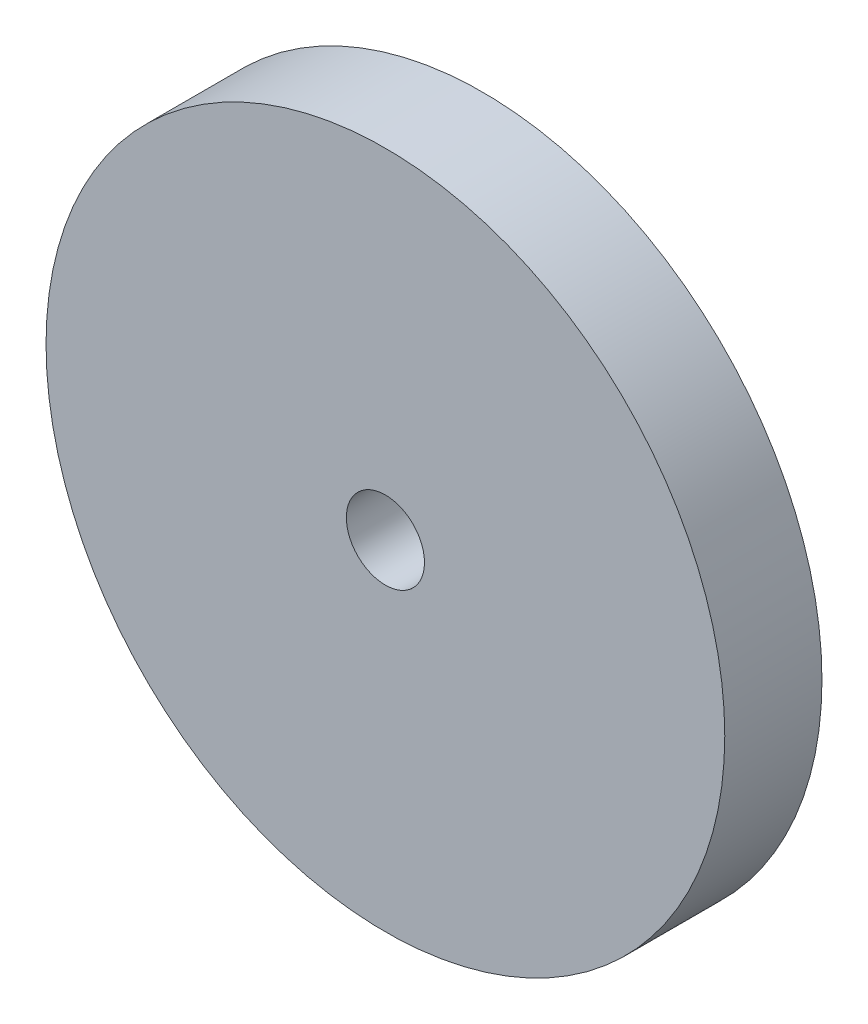
ISO-10303-21;
HEADER;
FILE_DESCRIPTION(('STEP AP214'),'2;1');
FILE_NAME('part.step','',(''),(''),'','','');
FILE_SCHEMA(('AUTOMOTIVE_DESIGN { 1 0 10303 214 1 1 1 1 }'));
ENDSEC;
DATA;
#1=APPLICATION_CONTEXT('core data for automotive mechanical design processes');
#2=APPLICATION_PROTOCOL_DEFINITION('international standard','automotive_design',2000,#1);
#3=PRODUCT_CONTEXT('',#1,'mechanical');
#4=PRODUCT('Part','Part','',(#3));
#5=PRODUCT_RELATED_PRODUCT_CATEGORY('part','',(#4));
#6=PRODUCT_DEFINITION_FORMATION('','',#4);
#7=PRODUCT_DEFINITION_CONTEXT('part definition',#1,'design');
#8=PRODUCT_DEFINITION('design','',#6,#7);
#9=PRODUCT_DEFINITION_SHAPE('','',#8);
#10=(LENGTH_UNIT() NAMED_UNIT(*) SI_UNIT(.MILLI.,.METRE.));
#11=(NAMED_UNIT(*) PLANE_ANGLE_UNIT() SI_UNIT($,.RADIAN.));
#12=(NAMED_UNIT(*) SI_UNIT($,.STERADIAN.) SOLID_ANGLE_UNIT());
#13=UNCERTAINTY_MEASURE_WITH_UNIT(LENGTH_MEASURE(1.E-05),#10,'distance_accuracy_value','');
#14=(GEOMETRIC_REPRESENTATION_CONTEXT(3) GLOBAL_UNCERTAINTY_ASSIGNED_CONTEXT((#13)) GLOBAL_UNIT_ASSIGNED_CONTEXT((#10,
#11,#12)) REPRESENTATION_CONTEXT('',''));
#15=CARTESIAN_POINT('',(0.,0.,0.));
#16=DIRECTION('',(0.,0.,1.));
#17=DIRECTION('',(1.,0.,0.));
#18=AXIS2_PLACEMENT_3D('',#15,#16,#17);
#19=CARTESIAN_POINT('',(0.,0.,6.35));
#20=DIRECTION('',(0.,0.,1.));
#21=DIRECTION('',(1.,0.,0.));
#22=AXIS2_PLACEMENT_3D('',#19,#20,#21);
#23=PLANE('',#22);
#24=CARTESIAN_POINT('',(0.,0.,6.35));
#25=DIRECTION('',(0.,0.,1.));
#26=DIRECTION('',(1.,0.,0.));
#27=AXIS2_PLACEMENT_3D('',#24,#25,#26);
#28=CIRCLE('',#27,22.175);
#29=CARTESIAN_POINT('',(22.175,0.,6.35));
#30=VERTEX_POINT('',#29);
#31=EDGE_CURVE('E10',#30,#30,#28,.T.);
#32=ORIENTED_EDGE('',*,*,#31,.T.);
#33=EDGE_LOOP('',(#32));
#34=FACE_BOUND('',#33,.T.);
#35=CARTESIAN_POINT('',(0.,0.,6.35));
#36=DIRECTION('',(0.,0.,1.));
#37=DIRECTION('',(1.,0.,0.));
#38=AXIS2_PLACEMENT_3D('',#35,#36,#37);
#39=CIRCLE('',#38,2.5527);
#40=CARTESIAN_POINT('',(2.5527,0.,6.35));
#41=VERTEX_POINT('',#40);
#42=EDGE_CURVE('E41',#41,#41,#39,.T.);
#43=ORIENTED_EDGE('',*,*,#42,.F.);
#44=EDGE_LOOP('',(#43));
#45=FACE_BOUND('',#44,.T.);
#46=ADVANCED_FACE('F30',(#34,#45),#23,.T.);
#47=CARTESIAN_POINT('',(0.,0.,0.));
#48=DIRECTION('',(0.,0.,1.));
#49=DIRECTION('',(1.,0.,0.));
#50=AXIS2_PLACEMENT_3D('',#47,#48,#49);
#51=PLANE('',#50);
#52=CARTESIAN_POINT('',(0.,0.,0.));
#53=DIRECTION('',(0.,0.,1.));
#54=DIRECTION('',(1.,0.,0.));
#55=AXIS2_PLACEMENT_3D('',#52,#53,#54);
#56=CIRCLE('',#55,22.175);
#57=CARTESIAN_POINT('',(22.175,0.,0.));
#58=VERTEX_POINT('',#57);
#59=EDGE_CURVE('E34',#58,#58,#56,.T.);
#60=ORIENTED_EDGE('',*,*,#59,.F.);
#61=EDGE_LOOP('',(#60));
#62=FACE_BOUND('',#61,.T.);
#63=CARTESIAN_POINT('',(0.,0.,0.));
#64=DIRECTION('',(0.,0.,1.));
#65=DIRECTION('',(1.,0.,0.));
#66=AXIS2_PLACEMENT_3D('',#63,#64,#65);
#67=CIRCLE('',#66,2.5527);
#68=CARTESIAN_POINT('',(2.5527,0.,0.));
#69=VERTEX_POINT('',#68);
#70=EDGE_CURVE('E43',#69,#69,#67,.T.);
#71=ORIENTED_EDGE('',*,*,#70,.T.);
#72=EDGE_LOOP('',(#71));
#73=FACE_BOUND('',#72,.T.);
#74=ADVANCED_FACE('F53',(#62,#73),#51,.F.);
#75=CARTESIAN_POINT('',(0.,0.,6.35));
#76=DIRECTION('',(0.,0.,-1.));
#77=DIRECTION('',(-1.,0.,0.));
#78=AXIS2_PLACEMENT_3D('',#75,#76,#77);
#79=CYLINDRICAL_SURFACE('',#78,22.175);
#80=ORIENTED_EDGE('',*,*,#31,.F.);
#81=EDGE_LOOP('',(#80));
#82=FACE_BOUND('',#81,.T.);
#83=ORIENTED_EDGE('',*,*,#59,.T.);
#84=EDGE_LOOP('',(#83));
#85=FACE_BOUND('',#84,.T.);
#86=ADVANCED_FACE('F32',(#82,#85),#79,.T.);
#87=CARTESIAN_POINT('',(0.,0.,6.35));
#88=DIRECTION('',(0.,0.,-1.));
#89=DIRECTION('',(-1.,0.,0.));
#90=AXIS2_PLACEMENT_3D('',#87,#88,#89);
#91=CYLINDRICAL_SURFACE('',#90,2.5527);
#92=ORIENTED_EDGE('',*,*,#42,.T.);
#93=EDGE_LOOP('',(#92));
#94=FACE_BOUND('',#93,.T.);
#95=ORIENTED_EDGE('',*,*,#70,.F.);
#96=EDGE_LOOP('',(#95));
#97=FACE_BOUND('',#96,.T.);
#98=ADVANCED_FACE('F49',(#94,#97),#91,.F.);
#99=CLOSED_SHELL('',(#46,#74,#86,#98));
#100=MANIFOLD_SOLID_BREP('B2',#99);
#101=ADVANCED_BREP_SHAPE_REPRESENTATION('',(#18,#100),#14);
#102=SHAPE_DEFINITION_REPRESENTATION(#9,#101);
ENDSEC;
END-ISO-10303-21;
